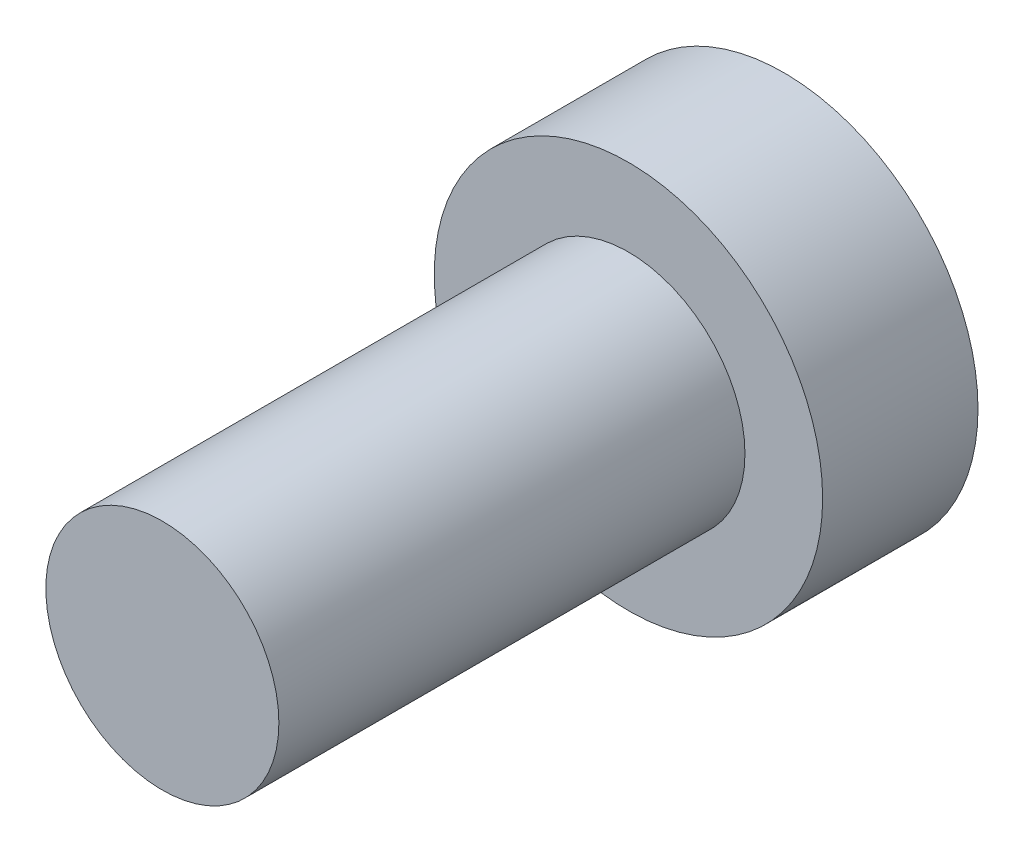
ISO-10303-21;
HEADER;
FILE_DESCRIPTION(('STEP AP214'),'2;1');
FILE_NAME('part.step','',(''),(''),'','','');
FILE_SCHEMA(('AUTOMOTIVE_DESIGN { 1 0 10303 214 1 1 1 1 }'));
ENDSEC;
DATA;
#1=APPLICATION_CONTEXT('core data for automotive mechanical design processes');
#2=APPLICATION_PROTOCOL_DEFINITION('international standard','automotive_design',2000,#1);
#3=PRODUCT_CONTEXT('',#1,'mechanical');
#4=PRODUCT('Part','Part','',(#3));
#5=PRODUCT_RELATED_PRODUCT_CATEGORY('part','',(#4));
#6=PRODUCT_DEFINITION_FORMATION('','',#4);
#7=PRODUCT_DEFINITION_CONTEXT('part definition',#1,'design');
#8=PRODUCT_DEFINITION('design','',#6,#7);
#9=PRODUCT_DEFINITION_SHAPE('','',#8);
#10=(LENGTH_UNIT() NAMED_UNIT(*) SI_UNIT(.MILLI.,.METRE.));
#11=(NAMED_UNIT(*) PLANE_ANGLE_UNIT() SI_UNIT($,.RADIAN.));
#12=(NAMED_UNIT(*) SI_UNIT($,.STERADIAN.) SOLID_ANGLE_UNIT());
#13=UNCERTAINTY_MEASURE_WITH_UNIT(LENGTH_MEASURE(1.E-05),#10,'distance_accuracy_value','');
#14=(GEOMETRIC_REPRESENTATION_CONTEXT(3) GLOBAL_UNCERTAINTY_ASSIGNED_CONTEXT((#13)) GLOBAL_UNIT_ASSIGNED_CONTEXT((#10,
#11,#12)) REPRESENTATION_CONTEXT('',''));
#15=CARTESIAN_POINT('',(0.,0.,0.));
#16=DIRECTION('',(0.,0.,1.));
#17=DIRECTION('',(1.,0.,0.));
#18=AXIS2_PLACEMENT_3D('',#15,#16,#17);
#19=CARTESIAN_POINT('',(0.,0.,2.));
#20=DIRECTION('',(0.,0.,-1.));
#21=DIRECTION('',(-1.,0.,0.));
#22=AXIS2_PLACEMENT_3D('',#19,#20,#21);
#23=CYLINDRICAL_SURFACE('',#22,2.5);
#24=CARTESIAN_POINT('',(0.,0.,2.));
#25=DIRECTION('',(0.,0.,1.));
#26=DIRECTION('',(1.,0.,0.));
#27=AXIS2_PLACEMENT_3D('',#24,#25,#26);
#28=CIRCLE('',#27,2.5);
#29=CARTESIAN_POINT('',(2.5,0.,2.));
#30=VERTEX_POINT('',#29);
#31=EDGE_CURVE('E45',#30,#30,#28,.T.);
#32=ORIENTED_EDGE('',*,*,#31,.F.);
#33=EDGE_LOOP('',(#32));
#34=FACE_BOUND('',#33,.T.);
#35=CARTESIAN_POINT('',(0.,0.,0.));
#36=DIRECTION('',(0.,0.,1.));
#37=DIRECTION('',(1.,0.,0.));
#38=AXIS2_PLACEMENT_3D('',#35,#36,#37);
#39=CIRCLE('',#38,2.5);
#40=CARTESIAN_POINT('',(2.5,0.,0.));
#41=VERTEX_POINT('',#40);
#42=EDGE_CURVE('E40',#41,#41,#39,.T.);
#43=ORIENTED_EDGE('',*,*,#42,.T.);
#44=EDGE_LOOP('',(#43));
#45=FACE_BOUND('',#44,.T.);
#46=ADVANCED_FACE('F37',(#34,#45),#23,.T.);
#47=CARTESIAN_POINT('',(0.,0.,2.));
#48=DIRECTION('',(0.,0.,1.));
#49=DIRECTION('',(1.,0.,0.));
#50=AXIS2_PLACEMENT_3D('',#47,#48,#49);
#51=PLANE('',#50);
#52=CARTESIAN_POINT('',(0.,0.,2.));
#53=DIRECTION('',(0.,0.,1.));
#54=DIRECTION('',(1.,0.,0.));
#55=AXIS2_PLACEMENT_3D('',#52,#53,#54);
#56=CIRCLE('',#55,1.5);
#57=CARTESIAN_POINT('',(1.5,0.,2.));
#58=VERTEX_POINT('',#57);
#59=EDGE_CURVE('E10',#58,#58,#56,.T.);
#60=ORIENTED_EDGE('',*,*,#59,.F.);
#61=EDGE_LOOP('',(#60));
#62=FACE_BOUND('',#61,.T.);
#63=ORIENTED_EDGE('',*,*,#31,.T.);
#64=EDGE_LOOP('',(#63));
#65=FACE_BOUND('',#64,.T.);
#66=ADVANCED_FACE('F65',(#62,#65),#51,.T.);
#67=CARTESIAN_POINT('',(0.,0.,0.));
#68=DIRECTION('',(0.,0.,1.));
#69=DIRECTION('',(1.,0.,0.));
#70=AXIS2_PLACEMENT_3D('',#67,#68,#69);
#71=PLANE('',#70);
#72=ORIENTED_EDGE('',*,*,#42,.F.);
#73=EDGE_LOOP('',(#72));
#74=FACE_BOUND('',#73,.T.);
#75=ADVANCED_FACE('F62',(#74),#71,.F.);
#76=CARTESIAN_POINT('',(0.,0.,8.));
#77=DIRECTION('',(0.,0.,-1.));
#78=DIRECTION('',(-1.,0.,0.));
#79=AXIS2_PLACEMENT_3D('',#76,#77,#78);
#80=CYLINDRICAL_SURFACE('',#79,1.5);
#81=CARTESIAN_POINT('',(0.,0.,8.));
#82=DIRECTION('',(0.,0.,1.));
#83=DIRECTION('',(1.,0.,0.));
#84=AXIS2_PLACEMENT_3D('',#81,#82,#83);
#85=CIRCLE('',#84,1.5);
#86=CARTESIAN_POINT('',(1.5,0.,8.));
#87=VERTEX_POINT('',#86);
#88=EDGE_CURVE('E52',#87,#87,#85,.T.);
#89=ORIENTED_EDGE('',*,*,#88,.F.);
#90=EDGE_LOOP('',(#89));
#91=FACE_BOUND('',#90,.T.);
#92=ORIENTED_EDGE('',*,*,#59,.T.);
#93=EDGE_LOOP('',(#92));
#94=FACE_BOUND('',#93,.T.);
#95=ADVANCED_FACE('F64',(#91,#94),#80,.T.);
#96=CARTESIAN_POINT('',(0.,0.,8.));
#97=DIRECTION('',(0.,0.,1.));
#98=DIRECTION('',(1.,0.,0.));
#99=AXIS2_PLACEMENT_3D('',#96,#97,#98);
#100=PLANE('',#99);
#101=ORIENTED_EDGE('',*,*,#88,.T.);
#102=EDGE_LOOP('',(#101));
#103=FACE_BOUND('',#102,.T.);
#104=ADVANCED_FACE('F70',(#103),#100,.T.);
#105=CLOSED_SHELL('',(#46,#66,#75,#95,#104));
#106=MANIFOLD_SOLID_BREP('B2',#105);
#107=ADVANCED_BREP_SHAPE_REPRESENTATION('',(#18,#106),#14);
#108=SHAPE_DEFINITION_REPRESENTATION(#9,#107);
ENDSEC;
END-ISO-10303-21;
